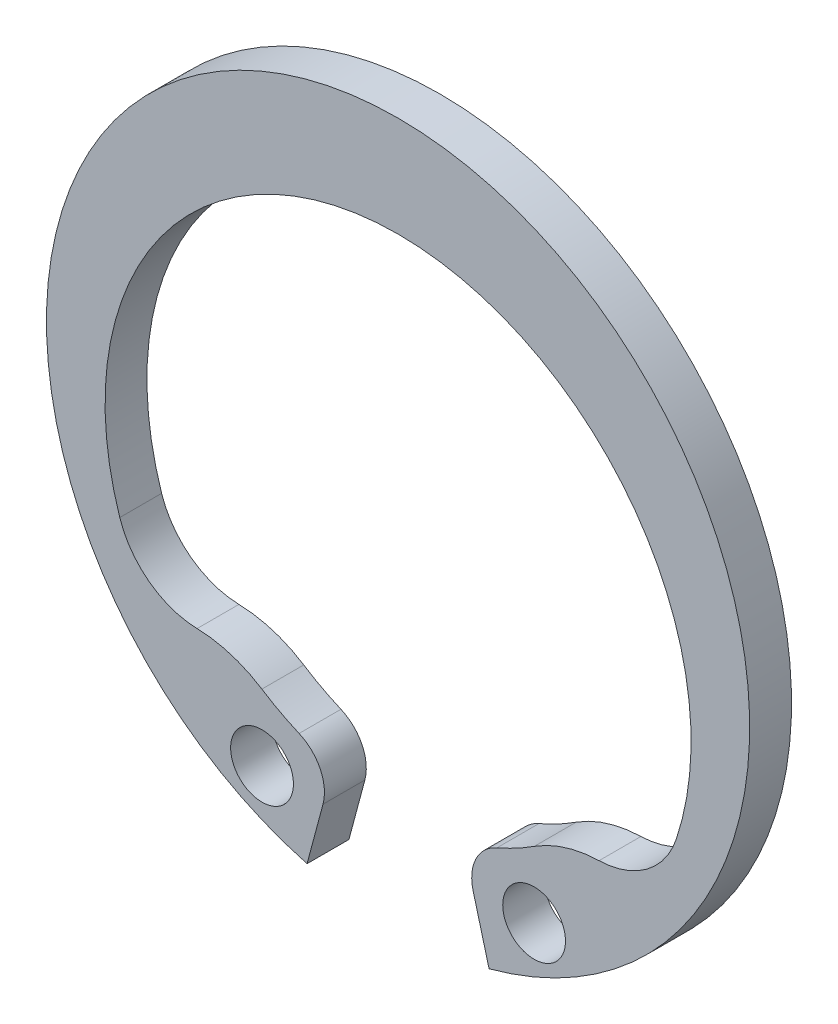
ISO-10303-21;
HEADER;
FILE_DESCRIPTION(('STEP AP214'),'2;1');
FILE_NAME('part.step','',(''),(''),'','','');
FILE_SCHEMA(('AUTOMOTIVE_DESIGN { 1 0 10303 214 1 1 1 1 }'));
ENDSEC;
DATA;
#1=APPLICATION_CONTEXT('core data for automotive mechanical design processes');
#2=APPLICATION_PROTOCOL_DEFINITION('international standard','automotive_design',2000,#1);
#3=PRODUCT_CONTEXT('',#1,'mechanical');
#4=PRODUCT('Part','Part','',(#3));
#5=PRODUCT_RELATED_PRODUCT_CATEGORY('part','',(#4));
#6=PRODUCT_DEFINITION_FORMATION('','',#4);
#7=PRODUCT_DEFINITION_CONTEXT('part definition',#1,'design');
#8=PRODUCT_DEFINITION('design','',#6,#7);
#9=PRODUCT_DEFINITION_SHAPE('','',#8);
#10=(LENGTH_UNIT() NAMED_UNIT(*) SI_UNIT(.MILLI.,.METRE.));
#11=(NAMED_UNIT(*) PLANE_ANGLE_UNIT() SI_UNIT($,.RADIAN.));
#12=(NAMED_UNIT(*) SI_UNIT($,.STERADIAN.) SOLID_ANGLE_UNIT());
#13=UNCERTAINTY_MEASURE_WITH_UNIT(LENGTH_MEASURE(1.E-05),#10,'distance_accuracy_value','');
#14=(GEOMETRIC_REPRESENTATION_CONTEXT(3) GLOBAL_UNCERTAINTY_ASSIGNED_CONTEXT((#13)) GLOBAL_UNIT_ASSIGNED_CONTEXT((#10,
#11,#12)) REPRESENTATION_CONTEXT('',''));
#15=CARTESIAN_POINT('',(0.,0.,0.));
#16=DIRECTION('',(0.,0.,1.));
#17=DIRECTION('',(1.,0.,0.));
#18=AXIS2_PLACEMENT_3D('',#15,#16,#17);
#19=CARTESIAN_POINT('',(0.,0.,1.));
#20=DIRECTION('',(0.,0.,-1.));
#21=DIRECTION('',(-1.,0.,0.));
#22=AXIS2_PLACEMENT_3D('',#19,#20,#21);
#23=PLANE('',#22);
#24=CARTESIAN_POINT('',(0.,0.,1.));
#25=DIRECTION('',(0.,0.,-1.));
#26=DIRECTION('',(-1.,0.,0.));
#27=AXIS2_PLACEMENT_3D('',#24,#25,#26);
#28=CIRCLE('',#27,8.4);
#29=CARTESIAN_POINT('',(-2.17407997886118,-8.11377694082817,1.));
#30=VERTEX_POINT('',#29);
#31=CARTESIAN_POINT('',(2.17407997886118,-8.11377694082817,1.));
#32=VERTEX_POINT('',#31);
#33=EDGE_CURVE('E138',#30,#32,#28,.T.);
#34=ORIENTED_EDGE('',*,*,#33,.F.);
#35=DIRECTION('',(0.258819045102522,0.965925826289068,0.));
#36=VECTOR('',#35,1.);
#37=CARTESIAN_POINT('',(-2.17407997886118,-8.11377694082817,1.));
#38=LINE('',#37,#36);
#39=CARTESIAN_POINT('',(-1.79315094433611,-6.69213042990246,1.));
#40=VERTEX_POINT('',#39);
#41=EDGE_CURVE('E55',#30,#40,#38,.T.);
#42=ORIENTED_EDGE('',*,*,#41,.T.);
#43=CARTESIAN_POINT('',(-2.75907677062518,-6.43331138479994,1.));
#44=DIRECTION('',(0.,0.,-1.));
#45=DIRECTION('',(-1.,0.,0.));
#46=AXIS2_PLACEMENT_3D('',#43,#44,#45);
#47=CIRCLE('',#46,1.);
#48=CARTESIAN_POINT('',(-2.36492294625016,-5.51426690125709,1.));
#49=VERTEX_POINT('',#48);
#50=EDGE_CURVE('E209',#49,#40,#47,.T.);
#51=ORIENTED_EDGE('',*,*,#50,.F.);
#52=CARTESIAN_POINT('',(0.,0.,1.));
#53=DIRECTION('',(0.,0.,-1.));
#54=DIRECTION('',(-1.,0.,0.));
#55=AXIS2_PLACEMENT_3D('',#52,#53,#54);
#56=CIRCLE('',#55,6.);
#57=CARTESIAN_POINT('',(-3.25377853054115,-5.04112341390185,1.));
#58=VERTEX_POINT('',#57);
#59=EDGE_CURVE('E207',#49,#58,#56,.T.);
#60=ORIENTED_EDGE('',*,*,#59,.T.);
#61=CARTESIAN_POINT('',(-4.88066779581173,-7.56168512085278,1.));
#62=DIRECTION('',(0.,0.,-1.));
#63=DIRECTION('',(-1.,0.,0.));
#64=AXIS2_PLACEMENT_3D('',#61,#62,#63);
#65=CIRCLE('',#64,3.);
#66=CARTESIAN_POINT('',(-4.80184042965936,-4.562720925277,1.));
#67=VERTEX_POINT('',#66);
#68=EDGE_CURVE('E204',#67,#58,#65,.T.);
#69=ORIENTED_EDGE('',*,*,#68,.F.);
#70=CARTESIAN_POINT('',(-4.74928885222445,-2.56341146155981,1.));
#71=DIRECTION('',(0.,0.,1.));
#72=DIRECTION('',(1.,0.,0.));
#73=AXIS2_PLACEMENT_3D('',#70,#71,#72);
#74=CIRCLE('',#73,2.);
#75=CARTESIAN_POINT('',(-6.64900439311423,-3.18877604618374,1.));
#76=VERTEX_POINT('',#75);
#77=EDGE_CURVE('E201',#76,#67,#74,.T.);
#78=ORIENTED_EDGE('',*,*,#77,.F.);
#79=CARTESIAN_POINT('',(0.,-1.,1.));
#80=DIRECTION('',(0.,0.,-1.));
#81=DIRECTION('',(-1.,0.,0.));
#82=AXIS2_PLACEMENT_3D('',#79,#80,#81);
#83=CIRCLE('',#82,7.);
#84=CARTESIAN_POINT('',(6.64900439311423,-3.18877604618374,1.));
#85=VERTEX_POINT('',#84);
#86=EDGE_CURVE('E199',#76,#85,#83,.T.);
#87=ORIENTED_EDGE('',*,*,#86,.T.);
#88=CARTESIAN_POINT('',(4.74928885222445,-2.56341146155981,1.));
#89=DIRECTION('',(0.,0.,-1.));
#90=DIRECTION('',(-1.,0.,0.));
#91=AXIS2_PLACEMENT_3D('',#88,#89,#90);
#92=CIRCLE('',#91,2.);
#93=CARTESIAN_POINT('',(4.80184042965936,-4.562720925277,1.));
#94=VERTEX_POINT('',#93);
#95=EDGE_CURVE('E143',#85,#94,#92,.T.);
#96=ORIENTED_EDGE('',*,*,#95,.T.);
#97=CARTESIAN_POINT('',(4.88066779581173,-7.56168512085278,1.));
#98=DIRECTION('',(0.,0.,1.));
#99=DIRECTION('',(1.,0.,0.));
#100=AXIS2_PLACEMENT_3D('',#97,#98,#99);
#101=CIRCLE('',#100,3.);
#102=CARTESIAN_POINT('',(3.25377853054115,-5.04112341390185,1.));
#103=VERTEX_POINT('',#102);
#104=EDGE_CURVE('E172',#94,#103,#101,.T.);
#105=ORIENTED_EDGE('',*,*,#104,.T.);
#106=CARTESIAN_POINT('',(0.,0.,1.));
#107=DIRECTION('',(0.,0.,1.));
#108=DIRECTION('',(1.,0.,0.));
#109=AXIS2_PLACEMENT_3D('',#106,#107,#108);
#110=CIRCLE('',#109,6.);
#111=CARTESIAN_POINT('',(2.36492294625016,-5.51426690125709,1.));
#112=VERTEX_POINT('',#111);
#113=EDGE_CURVE('E169',#112,#103,#110,.T.);
#114=ORIENTED_EDGE('',*,*,#113,.F.);
#115=CARTESIAN_POINT('',(2.75907677062518,-6.43331138479994,1.));
#116=DIRECTION('',(0.,0.,1.));
#117=DIRECTION('',(1.,0.,0.));
#118=AXIS2_PLACEMENT_3D('',#115,#116,#117);
#119=CIRCLE('',#118,1.);
#120=CARTESIAN_POINT('',(1.79315094433611,-6.69213042990246,1.));
#121=VERTEX_POINT('',#120);
#122=EDGE_CURVE('E167',#112,#121,#119,.T.);
#123=ORIENTED_EDGE('',*,*,#122,.T.);
#124=DIRECTION('',(-0.258819045102522,0.965925826289068,0.));
#125=VECTOR('',#124,1.);
#126=CARTESIAN_POINT('',(2.17407997886118,-8.11377694082817,1.));
#127=LINE('',#126,#125);
#128=EDGE_CURVE('E165',#32,#121,#127,.T.);
#129=ORIENTED_EDGE('',*,*,#128,.F.);
#130=EDGE_LOOP('',(#34,#42,#51,#60,#69,#78,#87,#96,#105,#114,#123,#129));
#131=FACE_BOUND('',#130,.T.);
#132=CARTESIAN_POINT('',(-3.24999999999996,-6.62916512459887,1.));
#133=DIRECTION('',(0.,0.,1.));
#134=DIRECTION('',(1.,0.,0.));
#135=AXIS2_PLACEMENT_3D('',#132,#133,#134);
#136=CIRCLE('',#135,0.75);
#137=CARTESIAN_POINT('',(-2.49999999999996,-6.62916512459887,1.));
#138=VERTEX_POINT('',#137);
#139=EDGE_CURVE('E154',#138,#138,#136,.T.);
#140=ORIENTED_EDGE('',*,*,#139,.F.);
#141=EDGE_LOOP('',(#140));
#142=FACE_BOUND('',#141,.T.);
#143=CARTESIAN_POINT('',(3.24999999999996,-6.62916512459887,1.));
#144=DIRECTION('',(0.,0.,-1.));
#145=DIRECTION('',(-1.,0.,0.));
#146=AXIS2_PLACEMENT_3D('',#143,#144,#145);
#147=CIRCLE('',#146,0.75);
#148=CARTESIAN_POINT('',(2.49999999999996,-6.62916512459887,1.));
#149=VERTEX_POINT('',#148);
#150=EDGE_CURVE('E310',#149,#149,#147,.T.);
#151=ORIENTED_EDGE('',*,*,#150,.T.);
#152=EDGE_LOOP('',(#151));
#153=FACE_BOUND('',#152,.T.);
#154=ADVANCED_FACE('F33',(#131,#142,#153),#23,.F.);
#155=CARTESIAN_POINT('',(0.,0.,0.));
#156=DIRECTION('',(0.,0.,-1.));
#157=DIRECTION('',(-1.,0.,0.));
#158=AXIS2_PLACEMENT_3D('',#155,#156,#157);
#159=PLANE('',#158);
#160=CARTESIAN_POINT('',(0.,0.,0.));
#161=DIRECTION('',(0.,0.,-1.));
#162=DIRECTION('',(-1.,0.,0.));
#163=AXIS2_PLACEMENT_3D('',#160,#161,#162);
#164=CIRCLE('',#163,8.4);
#165=CARTESIAN_POINT('',(-2.17407997886118,-8.11377694082817,0.));
#166=VERTEX_POINT('',#165);
#167=CARTESIAN_POINT('',(2.17407997886118,-8.11377694082817,0.));
#168=VERTEX_POINT('',#167);
#169=EDGE_CURVE('E123',#166,#168,#164,.T.);
#170=ORIENTED_EDGE('',*,*,#169,.T.);
#171=DIRECTION('',(-0.258819045102522,0.965925826289068,0.));
#172=VECTOR('',#171,1.);
#173=CARTESIAN_POINT('',(2.17407997886118,-8.11377694082817,0.));
#174=LINE('',#173,#172);
#175=CARTESIAN_POINT('',(1.79315094433611,-6.69213042990246,0.));
#176=VERTEX_POINT('',#175);
#177=EDGE_CURVE('E129',#168,#176,#174,.T.);
#178=ORIENTED_EDGE('',*,*,#177,.T.);
#179=CARTESIAN_POINT('',(2.75907677062518,-6.43331138479994,0.));
#180=DIRECTION('',(0.,0.,1.));
#181=DIRECTION('',(1.,0.,0.));
#182=AXIS2_PLACEMENT_3D('',#179,#180,#181);
#183=CIRCLE('',#182,1.);
#184=CARTESIAN_POINT('',(2.36492294625016,-5.51426690125709,0.));
#185=VERTEX_POINT('',#184);
#186=EDGE_CURVE('E148',#185,#176,#183,.T.);
#187=ORIENTED_EDGE('',*,*,#186,.F.);
#188=CARTESIAN_POINT('',(0.,0.,0.));
#189=DIRECTION('',(0.,0.,1.));
#190=DIRECTION('',(1.,0.,0.));
#191=AXIS2_PLACEMENT_3D('',#188,#189,#190);
#192=CIRCLE('',#191,6.);
#193=CARTESIAN_POINT('',(3.25377853054115,-5.04112341390185,0.));
#194=VERTEX_POINT('',#193);
#195=EDGE_CURVE('E151',#185,#194,#192,.T.);
#196=ORIENTED_EDGE('',*,*,#195,.T.);
#197=CARTESIAN_POINT('',(4.88066779581173,-7.56168512085278,0.));
#198=DIRECTION('',(0.,0.,1.));
#199=DIRECTION('',(1.,0.,0.));
#200=AXIS2_PLACEMENT_3D('',#197,#198,#199);
#201=CIRCLE('',#200,3.);
#202=CARTESIAN_POINT('',(4.80184042965936,-4.562720925277,0.));
#203=VERTEX_POINT('',#202);
#204=EDGE_CURVE('E160',#203,#194,#201,.T.);
#205=ORIENTED_EDGE('',*,*,#204,.F.);
#206=CARTESIAN_POINT('',(4.74928885222445,-2.56341146155981,0.));
#207=DIRECTION('',(0.,0.,-1.));
#208=DIRECTION('',(-1.,0.,0.));
#209=AXIS2_PLACEMENT_3D('',#206,#207,#208);
#210=CIRCLE('',#209,2.);
#211=CARTESIAN_POINT('',(6.64900439311423,-3.18877604618374,0.));
#212=VERTEX_POINT('',#211);
#213=EDGE_CURVE('E163',#212,#203,#210,.T.);
#214=ORIENTED_EDGE('',*,*,#213,.F.);
#215=CARTESIAN_POINT('',(0.,-1.,0.));
#216=DIRECTION('',(0.,0.,-1.));
#217=DIRECTION('',(-1.,0.,0.));
#218=AXIS2_PLACEMENT_3D('',#215,#216,#217);
#219=CIRCLE('',#218,7.);
#220=CARTESIAN_POINT('',(-6.64900439311423,-3.18877604618374,0.));
#221=VERTEX_POINT('',#220);
#222=EDGE_CURVE('E133',#221,#212,#219,.T.);
#223=ORIENTED_EDGE('',*,*,#222,.F.);
#224=CARTESIAN_POINT('',(-4.74928885222445,-2.56341146155981,0.));
#225=DIRECTION('',(0.,0.,1.));
#226=DIRECTION('',(1.,0.,0.));
#227=AXIS2_PLACEMENT_3D('',#224,#225,#226);
#228=CIRCLE('',#227,2.);
#229=CARTESIAN_POINT('',(-4.80184042965936,-4.562720925277,0.));
#230=VERTEX_POINT('',#229);
#231=EDGE_CURVE('E186',#221,#230,#228,.T.);
#232=ORIENTED_EDGE('',*,*,#231,.T.);
#233=CARTESIAN_POINT('',(-4.88066779581173,-7.56168512085278,0.));
#234=DIRECTION('',(0.,0.,-1.));
#235=DIRECTION('',(-1.,0.,0.));
#236=AXIS2_PLACEMENT_3D('',#233,#234,#235);
#237=CIRCLE('',#236,3.);
#238=CARTESIAN_POINT('',(-3.25377853054115,-5.04112341390185,0.));
#239=VERTEX_POINT('',#238);
#240=EDGE_CURVE('E189',#230,#239,#237,.T.);
#241=ORIENTED_EDGE('',*,*,#240,.T.);
#242=CARTESIAN_POINT('',(0.,0.,0.));
#243=DIRECTION('',(0.,0.,-1.));
#244=DIRECTION('',(-1.,0.,0.));
#245=AXIS2_PLACEMENT_3D('',#242,#243,#244);
#246=CIRCLE('',#245,6.);
#247=CARTESIAN_POINT('',(-2.36492294625016,-5.51426690125709,0.));
#248=VERTEX_POINT('',#247);
#249=EDGE_CURVE('E192',#248,#239,#246,.T.);
#250=ORIENTED_EDGE('',*,*,#249,.F.);
#251=CARTESIAN_POINT('',(-2.75907677062518,-6.43331138479994,0.));
#252=DIRECTION('',(0.,0.,-1.));
#253=DIRECTION('',(-1.,0.,0.));
#254=AXIS2_PLACEMENT_3D('',#251,#252,#253);
#255=CIRCLE('',#254,1.);
#256=CARTESIAN_POINT('',(-1.79315094433611,-6.69213042990246,0.));
#257=VERTEX_POINT('',#256);
#258=EDGE_CURVE('E195',#248,#257,#255,.T.);
#259=ORIENTED_EDGE('',*,*,#258,.T.);
#260=DIRECTION('',(0.258819045102522,0.965925826289068,0.));
#261=VECTOR('',#260,1.);
#262=CARTESIAN_POINT('',(-2.17407997886118,-8.11377694082817,0.));
#263=LINE('',#262,#261);
#264=EDGE_CURVE('E132',#166,#257,#263,.T.);
#265=ORIENTED_EDGE('',*,*,#264,.F.);
#266=EDGE_LOOP('',(#170,#178,#187,#196,#205,#214,#223,#232,#241,#250,#259,#265));
#267=FACE_BOUND('',#266,.T.);
#268=CARTESIAN_POINT('',(-3.24999999999996,-6.62916512459887,0.));
#269=DIRECTION('',(0.,0.,1.));
#270=DIRECTION('',(1.,0.,0.));
#271=AXIS2_PLACEMENT_3D('',#268,#269,#270);
#272=CIRCLE('',#271,0.75);
#273=CARTESIAN_POINT('',(-2.49999999999996,-6.62916512459887,0.));
#274=VERTEX_POINT('',#273);
#275=EDGE_CURVE('E149',#274,#274,#272,.T.);
#276=ORIENTED_EDGE('',*,*,#275,.T.);
#277=EDGE_LOOP('',(#276));
#278=FACE_BOUND('',#277,.T.);
#279=CARTESIAN_POINT('',(3.24999999999996,-6.62916512459887,0.));
#280=DIRECTION('',(0.,0.,-1.));
#281=DIRECTION('',(-1.,0.,0.));
#282=AXIS2_PLACEMENT_3D('',#279,#280,#281);
#283=CIRCLE('',#282,0.75);
#284=CARTESIAN_POINT('',(2.49999999999996,-6.62916512459887,0.));
#285=VERTEX_POINT('',#284);
#286=EDGE_CURVE('E308',#285,#285,#283,.T.);
#287=ORIENTED_EDGE('',*,*,#286,.F.);
#288=EDGE_LOOP('',(#287));
#289=FACE_BOUND('',#288,.T.);
#290=ADVANCED_FACE('F125',(#267,#278,#289),#159,.T.);
#291=CARTESIAN_POINT('',(0.,0.,1.));
#292=DIRECTION('',(0.,0.,-1.));
#293=DIRECTION('',(-1.,0.,0.));
#294=AXIS2_PLACEMENT_3D('',#291,#292,#293);
#295=CYLINDRICAL_SURFACE('',#294,8.4);
#296=ORIENTED_EDGE('',*,*,#169,.F.);
#297=DIRECTION('',(0.,0.,-1.));
#298=VECTOR('',#297,1.);
#299=CARTESIAN_POINT('',(-2.17407997886118,-8.11377694082817,1.));
#300=LINE('',#299,#298);
#301=EDGE_CURVE('E11',#30,#166,#300,.T.);
#302=ORIENTED_EDGE('',*,*,#301,.F.);
#303=ORIENTED_EDGE('',*,*,#33,.T.);
#304=DIRECTION('',(0.,0.,-1.));
#305=VECTOR('',#304,1.);
#306=CARTESIAN_POINT('',(2.17407997886118,-8.11377694082817,1.));
#307=LINE('',#306,#305);
#308=EDGE_CURVE('E137',#32,#168,#307,.T.);
#309=ORIENTED_EDGE('',*,*,#308,.T.);
#310=EDGE_LOOP('',(#296,#302,#303,#309));
#311=FACE_BOUND('',#310,.T.);
#312=ADVANCED_FACE('F35',(#311),#295,.T.);
#313=CARTESIAN_POINT('',(-2.17407997886118,-8.11377694082817,1.));
#314=DIRECTION('',(-0.965925826289068,0.258819045102522,0.));
#315=DIRECTION('',(-0.258819045102522,-0.965925826289068,0.));
#316=AXIS2_PLACEMENT_3D('',#313,#314,#315);
#317=PLANE('',#316);
#318=ORIENTED_EDGE('',*,*,#264,.T.);
#319=DIRECTION('',(0.,0.,-1.));
#320=VECTOR('',#319,1.);
#321=CARTESIAN_POINT('',(-1.79315094433611,-6.69213042990246,1.));
#322=LINE('',#321,#320);
#323=EDGE_CURVE('E42',#40,#257,#322,.T.);
#324=ORIENTED_EDGE('',*,*,#323,.F.);
#325=ORIENTED_EDGE('',*,*,#41,.F.);
#326=ORIENTED_EDGE('',*,*,#301,.T.);
#327=EDGE_LOOP('',(#318,#324,#325,#326));
#328=FACE_BOUND('',#327,.T.);
#329=ADVANCED_FACE('F250',(#328),#317,.F.);
#330=CARTESIAN_POINT('',(-2.75907677062518,-6.43331138479994,1.));
#331=DIRECTION('',(0.,0.,-1.));
#332=DIRECTION('',(-1.,0.,0.));
#333=AXIS2_PLACEMENT_3D('',#330,#331,#332);
#334=CYLINDRICAL_SURFACE('',#333,1.);
#335=ORIENTED_EDGE('',*,*,#258,.F.);
#336=DIRECTION('',(0.,0.,-1.));
#337=VECTOR('',#336,1.);
#338=CARTESIAN_POINT('',(-2.36492294625016,-5.51426690125709,1.));
#339=LINE('',#338,#337);
#340=EDGE_CURVE('E214',#49,#248,#339,.T.);
#341=ORIENTED_EDGE('',*,*,#340,.F.);
#342=ORIENTED_EDGE('',*,*,#50,.T.);
#343=ORIENTED_EDGE('',*,*,#323,.T.);
#344=EDGE_LOOP('',(#335,#341,#342,#343));
#345=FACE_BOUND('',#344,.T.);
#346=ADVANCED_FACE('F253',(#345),#334,.T.);
#347=CARTESIAN_POINT('',(0.,0.,1.));
#348=DIRECTION('',(0.,0.,-1.));
#349=DIRECTION('',(-1.,0.,0.));
#350=AXIS2_PLACEMENT_3D('',#347,#348,#349);
#351=CYLINDRICAL_SURFACE('',#350,6.);
#352=ORIENTED_EDGE('',*,*,#249,.T.);
#353=DIRECTION('',(0.,0.,-1.));
#354=VECTOR('',#353,1.);
#355=CARTESIAN_POINT('',(-3.25377853054115,-5.04112341390185,1.));
#356=LINE('',#355,#354);
#357=EDGE_CURVE('E216',#58,#239,#356,.T.);
#358=ORIENTED_EDGE('',*,*,#357,.F.);
#359=ORIENTED_EDGE('',*,*,#59,.F.);
#360=ORIENTED_EDGE('',*,*,#340,.T.);
#361=EDGE_LOOP('',(#352,#358,#359,#360));
#362=FACE_BOUND('',#361,.T.);
#363=ADVANCED_FACE('F238',(#362),#351,.F.);
#364=CARTESIAN_POINT('',(-4.88066779581173,-7.56168512085278,1.));
#365=DIRECTION('',(0.,0.,-1.));
#366=DIRECTION('',(-1.,0.,0.));
#367=AXIS2_PLACEMENT_3D('',#364,#365,#366);
#368=CYLINDRICAL_SURFACE('',#367,3.);
#369=ORIENTED_EDGE('',*,*,#240,.F.);
#370=DIRECTION('',(0.,0.,-1.));
#371=VECTOR('',#370,1.);
#372=CARTESIAN_POINT('',(-4.80184042965936,-4.562720925277,1.));
#373=LINE('',#372,#371);
#374=EDGE_CURVE('E217',#67,#230,#373,.T.);
#375=ORIENTED_EDGE('',*,*,#374,.F.);
#376=ORIENTED_EDGE('',*,*,#68,.T.);
#377=ORIENTED_EDGE('',*,*,#357,.T.);
#378=EDGE_LOOP('',(#369,#375,#376,#377));
#379=FACE_BOUND('',#378,.T.);
#380=ADVANCED_FACE('F231',(#379),#368,.T.);
#381=CARTESIAN_POINT('',(-4.74928885222445,-2.56341146155981,1.));
#382=DIRECTION('',(0.,0.,-1.));
#383=DIRECTION('',(-1.,0.,0.));
#384=AXIS2_PLACEMENT_3D('',#381,#382,#383);
#385=CYLINDRICAL_SURFACE('',#384,2.);
#386=ORIENTED_EDGE('',*,*,#231,.F.);
#387=DIRECTION('',(0.,0.,-1.));
#388=VECTOR('',#387,1.);
#389=CARTESIAN_POINT('',(-6.64900439311423,-3.18877604618374,1.));
#390=LINE('',#389,#388);
#391=EDGE_CURVE('E37',#76,#221,#390,.T.);
#392=ORIENTED_EDGE('',*,*,#391,.F.);
#393=ORIENTED_EDGE('',*,*,#77,.T.);
#394=ORIENTED_EDGE('',*,*,#374,.T.);
#395=EDGE_LOOP('',(#386,#392,#393,#394));
#396=FACE_BOUND('',#395,.T.);
#397=ADVANCED_FACE('F229',(#396),#385,.F.);
#398=CARTESIAN_POINT('',(0.,-1.,1.));
#399=DIRECTION('',(0.,0.,-1.));
#400=DIRECTION('',(-1.,0.,0.));
#401=AXIS2_PLACEMENT_3D('',#398,#399,#400);
#402=CYLINDRICAL_SURFACE('',#401,7.);
#403=ORIENTED_EDGE('',*,*,#222,.T.);
#404=DIRECTION('',(0.,0.,-1.));
#405=VECTOR('',#404,1.);
#406=CARTESIAN_POINT('',(6.64900439311423,-3.18877604618374,1.));
#407=LINE('',#406,#405);
#408=EDGE_CURVE('E134',#85,#212,#407,.T.);
#409=ORIENTED_EDGE('',*,*,#408,.F.);
#410=ORIENTED_EDGE('',*,*,#86,.F.);
#411=ORIENTED_EDGE('',*,*,#391,.T.);
#412=EDGE_LOOP('',(#403,#409,#410,#411));
#413=FACE_BOUND('',#412,.T.);
#414=ADVANCED_FACE('F224',(#413),#402,.F.);
#415=CARTESIAN_POINT('',(4.74928885222445,-2.56341146155981,1.));
#416=DIRECTION('',(0.,0.,-1.));
#417=DIRECTION('',(-1.,0.,0.));
#418=AXIS2_PLACEMENT_3D('',#415,#416,#417);
#419=CYLINDRICAL_SURFACE('',#418,2.);
#420=ORIENTED_EDGE('',*,*,#213,.T.);
#421=DIRECTION('',(0.,0.,-1.));
#422=VECTOR('',#421,1.);
#423=CARTESIAN_POINT('',(4.80184042965936,-4.562720925277,1.));
#424=LINE('',#423,#422);
#425=EDGE_CURVE('E177',#94,#203,#424,.T.);
#426=ORIENTED_EDGE('',*,*,#425,.F.);
#427=ORIENTED_EDGE('',*,*,#95,.F.);
#428=ORIENTED_EDGE('',*,*,#408,.T.);
#429=EDGE_LOOP('',(#420,#426,#427,#428));
#430=FACE_BOUND('',#429,.T.);
#431=ADVANCED_FACE('F237',(#430),#419,.F.);
#432=CARTESIAN_POINT('',(4.88066779581173,-7.56168512085278,1.));
#433=DIRECTION('',(0.,0.,-1.));
#434=DIRECTION('',(-1.,0.,0.));
#435=AXIS2_PLACEMENT_3D('',#432,#433,#434);
#436=CYLINDRICAL_SURFACE('',#435,3.);
#437=ORIENTED_EDGE('',*,*,#204,.T.);
#438=DIRECTION('',(0.,0.,-1.));
#439=VECTOR('',#438,1.);
#440=CARTESIAN_POINT('',(3.25377853054115,-5.04112341390185,1.));
#441=LINE('',#440,#439);
#442=EDGE_CURVE('E180',#103,#194,#441,.T.);
#443=ORIENTED_EDGE('',*,*,#442,.F.);
#444=ORIENTED_EDGE('',*,*,#104,.F.);
#445=ORIENTED_EDGE('',*,*,#425,.T.);
#446=EDGE_LOOP('',(#437,#443,#444,#445));
#447=FACE_BOUND('',#446,.T.);
#448=ADVANCED_FACE('F277',(#447),#436,.T.);
#449=CARTESIAN_POINT('',(0.,0.,1.));
#450=DIRECTION('',(0.,0.,-1.));
#451=DIRECTION('',(-1.,0.,0.));
#452=AXIS2_PLACEMENT_3D('',#449,#450,#451);
#453=CYLINDRICAL_SURFACE('',#452,6.);
#454=ORIENTED_EDGE('',*,*,#195,.F.);
#455=DIRECTION('',(0.,0.,-1.));
#456=VECTOR('',#455,1.);
#457=CARTESIAN_POINT('',(2.36492294625016,-5.51426690125709,1.));
#458=LINE('',#457,#456);
#459=EDGE_CURVE('E182',#112,#185,#458,.T.);
#460=ORIENTED_EDGE('',*,*,#459,.F.);
#461=ORIENTED_EDGE('',*,*,#113,.T.);
#462=ORIENTED_EDGE('',*,*,#442,.T.);
#463=EDGE_LOOP('',(#454,#460,#461,#462));
#464=FACE_BOUND('',#463,.T.);
#465=ADVANCED_FACE('F273',(#464),#453,.F.);
#466=CARTESIAN_POINT('',(2.75907677062518,-6.43331138479994,1.));
#467=DIRECTION('',(0.,0.,-1.));
#468=DIRECTION('',(-1.,0.,0.));
#469=AXIS2_PLACEMENT_3D('',#466,#467,#468);
#470=CYLINDRICAL_SURFACE('',#469,1.);
#471=ORIENTED_EDGE('',*,*,#186,.T.);
#472=DIRECTION('',(0.,0.,-1.));
#473=VECTOR('',#472,1.);
#474=CARTESIAN_POINT('',(1.79315094433611,-6.69213042990246,1.));
#475=LINE('',#474,#473);
#476=EDGE_CURVE('E142',#121,#176,#475,.T.);
#477=ORIENTED_EDGE('',*,*,#476,.F.);
#478=ORIENTED_EDGE('',*,*,#122,.F.);
#479=ORIENTED_EDGE('',*,*,#459,.T.);
#480=EDGE_LOOP('',(#471,#477,#478,#479));
#481=FACE_BOUND('',#480,.T.);
#482=ADVANCED_FACE('F270',(#481),#470,.T.);
#483=CARTESIAN_POINT('',(2.17407997886118,-8.11377694082817,1.));
#484=DIRECTION('',(-0.965925826289068,-0.258819045102522,0.));
#485=DIRECTION('',(0.258819045102522,-0.965925826289068,0.));
#486=AXIS2_PLACEMENT_3D('',#483,#484,#485);
#487=PLANE('',#486);
#488=ORIENTED_EDGE('',*,*,#177,.F.);
#489=ORIENTED_EDGE('',*,*,#308,.F.);
#490=ORIENTED_EDGE('',*,*,#128,.T.);
#491=ORIENTED_EDGE('',*,*,#476,.T.);
#492=EDGE_LOOP('',(#488,#489,#490,#491));
#493=FACE_BOUND('',#492,.T.);
#494=ADVANCED_FACE('F145',(#493),#487,.T.);
#495=CARTESIAN_POINT('',(-3.24999999999996,-6.62916512459887,0.));
#496=DIRECTION('',(0.,0.,1.));
#497=DIRECTION('',(1.,0.,0.));
#498=AXIS2_PLACEMENT_3D('',#495,#496,#497);
#499=CYLINDRICAL_SURFACE('',#498,0.75);
#500=ORIENTED_EDGE('',*,*,#275,.F.);
#501=EDGE_LOOP('',(#500));
#502=FACE_BOUND('',#501,.T.);
#503=ORIENTED_EDGE('',*,*,#139,.T.);
#504=EDGE_LOOP('',(#503));
#505=FACE_BOUND('',#504,.T.);
#506=ADVANCED_FACE('F288',(#502,#505),#499,.F.);
#507=CARTESIAN_POINT('',(3.24999999999996,-6.62916512459887,0.));
#508=DIRECTION('',(0.,0.,1.));
#509=DIRECTION('',(1.,0.,0.));
#510=AXIS2_PLACEMENT_3D('',#507,#508,#509);
#511=CYLINDRICAL_SURFACE('',#510,0.75);
#512=ORIENTED_EDGE('',*,*,#286,.T.);
#513=EDGE_LOOP('',(#512));
#514=FACE_BOUND('',#513,.T.);
#515=ORIENTED_EDGE('',*,*,#150,.F.);
#516=EDGE_LOOP('',(#515));
#517=FACE_BOUND('',#516,.T.);
#518=ADVANCED_FACE('F298',(#514,#517),#511,.F.);
#519=CLOSED_SHELL('',(#154,#290,#312,#329,#346,#363,#380,#397,#414,#431,#448,#465,#482,#494,
#506,#518));
#520=MANIFOLD_SOLID_BREP('B2',#519);
#521=ADVANCED_BREP_SHAPE_REPRESENTATION('',(#18,#520),#14);
#522=SHAPE_DEFINITION_REPRESENTATION(#9,#521);
ENDSEC;
END-ISO-10303-21;
